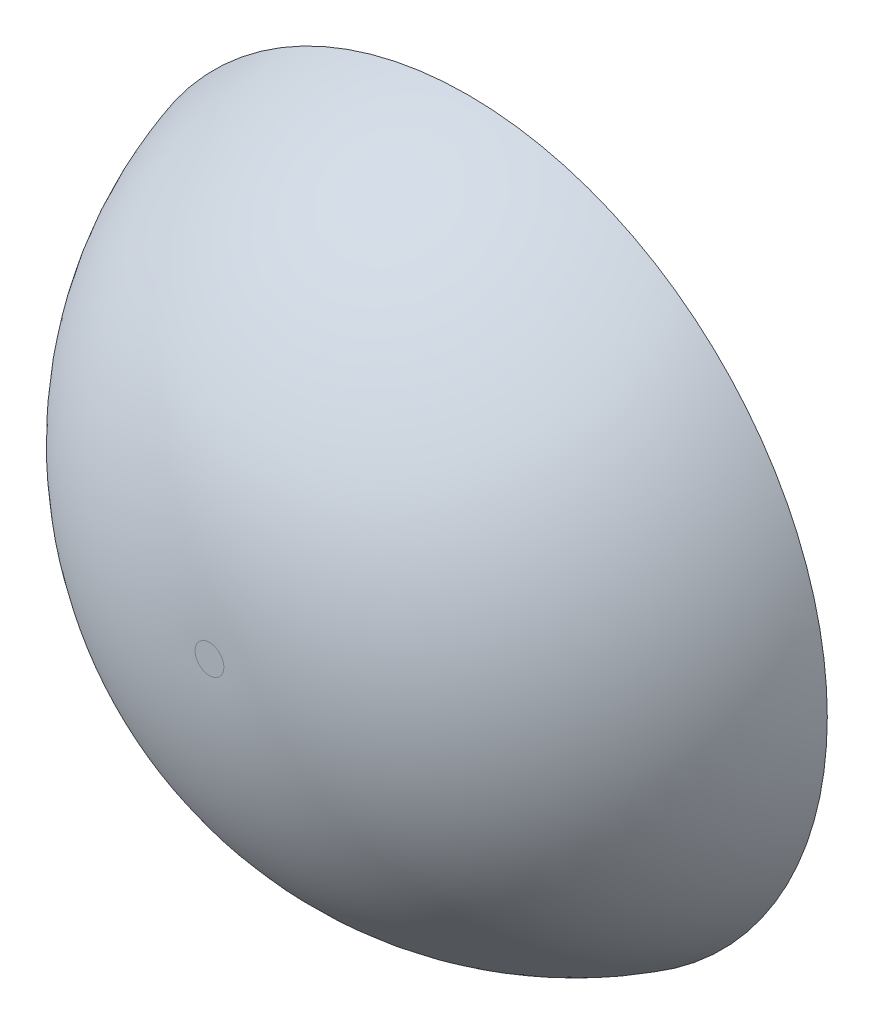
ISO-10303-21;
HEADER;
FILE_DESCRIPTION(('STEP AP214'),'2;1');
FILE_NAME('part.step','',(''),(''),'','','');
FILE_SCHEMA(('AUTOMOTIVE_DESIGN { 1 0 10303 214 1 1 1 1 }'));
ENDSEC;
DATA;
#1=APPLICATION_CONTEXT('core data for automotive mechanical design processes');
#2=APPLICATION_PROTOCOL_DEFINITION('international standard','automotive_design',2000,#1);
#3=PRODUCT_CONTEXT('',#1,'mechanical');
#4=PRODUCT('Part','Part','',(#3));
#5=PRODUCT_RELATED_PRODUCT_CATEGORY('part','',(#4));
#6=PRODUCT_DEFINITION_FORMATION('','',#4);
#7=PRODUCT_DEFINITION_CONTEXT('part definition',#1,'design');
#8=PRODUCT_DEFINITION('design','',#6,#7);
#9=PRODUCT_DEFINITION_SHAPE('','',#8);
#10=(LENGTH_UNIT() NAMED_UNIT(*) SI_UNIT(.MILLI.,.METRE.));
#11=(NAMED_UNIT(*) PLANE_ANGLE_UNIT() SI_UNIT($,.RADIAN.));
#12=(NAMED_UNIT(*) SI_UNIT($,.STERADIAN.) SOLID_ANGLE_UNIT());
#13=UNCERTAINTY_MEASURE_WITH_UNIT(LENGTH_MEASURE(1.E-05),#10,'distance_accuracy_value','');
#14=(GEOMETRIC_REPRESENTATION_CONTEXT(3) GLOBAL_UNCERTAINTY_ASSIGNED_CONTEXT((#13)) GLOBAL_UNIT_ASSIGNED_CONTEXT((#10,
#11,#12)) REPRESENTATION_CONTEXT('',''));
#15=CARTESIAN_POINT('',(0.,0.,0.));
#16=DIRECTION('',(0.,0.,1.));
#17=DIRECTION('',(1.,0.,0.));
#18=AXIS2_PLACEMENT_3D('',#15,#16,#17);
#19=CARTESIAN_POINT('',(0.,0.,18.));
#20=DIRECTION('',(0.,0.,1.));
#21=DIRECTION('',(1.,0.,0.));
#22=AXIS2_PLACEMENT_3D('',#19,#20,#21);
#23=PLANE('',#22);
#24=CARTESIAN_POINT('',(0.,0.,18.));
#25=DIRECTION('',(0.,0.,1.));
#26=DIRECTION('',(1.,0.,0.));
#27=AXIS2_PLACEMENT_3D('',#24,#25,#26);
#28=CIRCLE('',#27,0.999999999999997);
#29=CARTESIAN_POINT('',(0.999999999999997,0.,18.));
#30=VERTEX_POINT('',#29);
#31=EDGE_CURVE('E10',#30,#30,#28,.T.);
#32=ORIENTED_EDGE('',*,*,#31,.T.);
#33=EDGE_LOOP('',(#32));
#34=FACE_BOUND('',#33,.T.);
#35=ADVANCED_FACE('F33',(#34),#23,.T.);
#36=CARTESIAN_POINT('',(0.,0.,0.));
#37=DIRECTION('',(0.,0.,1.));
#38=DIRECTION('',(1.,0.,0.));
#39=AXIS2_PLACEMENT_3D('',#36,#37,#38);
#40=PLANE('',#39);
#41=CARTESIAN_POINT('',(-6.9703966151604,-12.0730810863642,0.));
#42=DIRECTION('',(0.,0.,1.));
#43=DIRECTION('',(0.499999999999992,0.866025403784443,0.));
#44=AXIS2_PLACEMENT_3D('',#41,#42,#43);
#45=ELLIPSE('',#44,3.15250024912521,2.15);
#46=CARTESIAN_POINT('',(-5.39414649059782,-9.34293578518498,0.));
#47=VERTEX_POINT('',#46);
#48=EDGE_CURVE('E37',#47,#47,#45,.T.);
#49=ORIENTED_EDGE('',*,*,#48,.T.);
#50=EDGE_LOOP('',(#49));
#51=FACE_BOUND('',#50,.T.);
#52=CARTESIAN_POINT('',(-6.97039661516057,12.0730810863641,0.));
#53=DIRECTION('',(0.,0.,1.));
#54=DIRECTION('',(0.500000000000004,-0.866025403784436,0.));
#55=AXIS2_PLACEMENT_3D('',#52,#53,#54);
#56=ELLIPSE('',#55,3.15250024912521,2.15);
#57=CARTESIAN_POINT('',(-5.39414649059795,9.3429357851849,0.));
#58=VERTEX_POINT('',#57);
#59=EDGE_CURVE('E52',#58,#58,#56,.T.);
#60=ORIENTED_EDGE('',*,*,#59,.T.);
#61=EDGE_LOOP('',(#60));
#62=FACE_BOUND('',#61,.T.);
#63=CARTESIAN_POINT('',(13.940793230321,0.,0.));
#64=DIRECTION('',(0.,0.,1.));
#65=DIRECTION('',(-1.,0.,0.));
#66=AXIS2_PLACEMENT_3D('',#63,#64,#65);
#67=ELLIPSE('',#66,3.15250024912521,2.15);
#68=CARTESIAN_POINT('',(10.7882929811958,0.,0.));
#69=VERTEX_POINT('',#68);
#70=EDGE_CURVE('E46',#69,#69,#67,.T.);
#71=ORIENTED_EDGE('',*,*,#70,.T.);
#72=EDGE_LOOP('',(#71));
#73=FACE_BOUND('',#72,.T.);
#74=CARTESIAN_POINT('',(0.,0.,0.));
#75=DIRECTION('',(0.,0.,1.));
#76=DIRECTION('',(1.,0.,0.));
#77=AXIS2_PLACEMENT_3D('',#74,#75,#76);
#78=CIRCLE('',#77,25.);
#79=CARTESIAN_POINT('',(25.,0.,0.));
#80=VERTEX_POINT('',#79);
#81=EDGE_CURVE('E41',#80,#80,#78,.T.);
#82=ORIENTED_EDGE('',*,*,#81,.F.);
#83=EDGE_LOOP('',(#82));
#84=FACE_BOUND('',#83,.T.);
#85=ADVANCED_FACE('F80',(#51,#62,#73,#84),#40,.F.);
#86=CARTESIAN_POINT('',(0.,0.,-7.));
#87=DIRECTION('',(0.,0.,-1.));
#88=DIRECTION('',(-1.,0.,0.));
#89=AXIS2_PLACEMENT_3D('',#86,#87,#88);
#90=DEGENERATE_TOROIDAL_SURFACE('',#89,0.999999999999997,25.,.T.);
#91=ORIENTED_EDGE('',*,*,#81,.T.);
#92=EDGE_LOOP('',(#91));
#93=FACE_BOUND('',#92,.T.);
#94=ORIENTED_EDGE('',*,*,#31,.F.);
#95=EDGE_LOOP('',(#94));
#96=FACE_BOUND('',#95,.T.);
#97=ADVANCED_FACE('F35',(#93,#96),#90,.T.);
#98=CARTESIAN_POINT('',(0.,0.,13.));
#99=DIRECTION('',(-0.731353701619174,0.,0.681998360062495));
#100=DIRECTION('',(0.681998360062495,0.,0.731353701619174));
#101=AXIS2_PLACEMENT_3D('',#98,#99,#100);
#102=CYLINDRICAL_SURFACE('',#101,2.15);
#103=CARTESIAN_POINT('',(3.65676850809587,0.,9.59000819968753));
#104=DIRECTION('',(-0.731353701619174,0.,0.681998360062495));
#105=DIRECTION('',(0.681998360062495,0.,0.731353701619174));
#106=AXIS2_PLACEMENT_3D('',#103,#104,#105);
#107=CIRCLE('',#106,2.15);
#108=CARTESIAN_POINT('',(5.12306498223024,0.,11.1624186581688));
#109=VERTEX_POINT('',#108);
#110=EDGE_CURVE('E51',#109,#109,#107,.T.);
#111=ORIENTED_EDGE('',*,*,#110,.T.);
#112=EDGE_LOOP('',(#111));
#113=FACE_BOUND('',#112,.T.);
#114=ORIENTED_EDGE('',*,*,#70,.F.);
#115=EDGE_LOOP('',(#114));
#116=FACE_BOUND('',#115,.T.);
#117=ADVANCED_FACE('F87',(#113,#116),#102,.F.);
#118=CARTESIAN_POINT('',(3.65676850809587,0.,9.59000819968752));
#119=DIRECTION('',(-0.731353701619174,0.,0.681998360062495));
#120=DIRECTION('',(0.681998360062495,0.,0.731353701619174));
#121=AXIS2_PLACEMENT_3D('',#118,#119,#120);
#122=PLANE('',#121);
#123=ORIENTED_EDGE('',*,*,#110,.F.);
#124=EDGE_LOOP('',(#123));
#125=FACE_BOUND('',#124,.T.);
#126=ADVANCED_FACE('F90',(#125),#122,.F.);
#127=CARTESIAN_POINT('',(0.,0.,13.));
#128=DIRECTION('',(0.36567685080959,-0.633370884753988,0.681998360062495));
#129=DIRECTION('',(-0.34099918003125,0.590627905153445,0.731353701619174));
#130=AXIS2_PLACEMENT_3D('',#127,#128,#129);
#131=CYLINDRICAL_SURFACE('',#130,2.15);
#132=CARTESIAN_POINT('',(-1.82838425404795,3.16685442376994,9.59000819968753));
#133=DIRECTION('',(0.36567685080959,-0.633370884753988,0.681998360062495));
#134=DIRECTION('',(-0.34099918003125,0.590627905153445,0.731353701619174));
#135=AXIS2_PLACEMENT_3D('',#132,#133,#134);
#136=CIRCLE('',#135,2.15);
#137=CARTESIAN_POINT('',(-2.56153249111514,4.43670441984985,11.1624186581688));
#138=VERTEX_POINT('',#137);
#139=EDGE_CURVE('E54',#138,#138,#136,.T.);
#140=ORIENTED_EDGE('',*,*,#139,.T.);
#141=EDGE_LOOP('',(#140));
#142=FACE_BOUND('',#141,.T.);
#143=ORIENTED_EDGE('',*,*,#59,.F.);
#144=EDGE_LOOP('',(#143));
#145=FACE_BOUND('',#144,.T.);
#146=ADVANCED_FACE('F94',(#142,#145),#131,.F.);
#147=CARTESIAN_POINT('',(-1.82838425404795,3.16685442376994,9.59000819968752));
#148=DIRECTION('',(0.36567685080959,-0.633370884753988,0.681998360062495));
#149=DIRECTION('',(-0.34099918003125,0.590627905153445,0.731353701619174));
#150=AXIS2_PLACEMENT_3D('',#147,#148,#149);
#151=PLANE('',#150);
#152=ORIENTED_EDGE('',*,*,#139,.F.);
#153=EDGE_LOOP('',(#152));
#154=FACE_BOUND('',#153,.T.);
#155=ADVANCED_FACE('F77',(#154),#151,.F.);
#156=CARTESIAN_POINT('',(0.,0.,13.));
#157=DIRECTION('',(0.365676850809581,0.633370884753993,0.681998360062495));
#158=DIRECTION('',(-0.340999180031242,-0.59062790515345,0.731353701619174));
#159=AXIS2_PLACEMENT_3D('',#156,#157,#158);
#160=CYLINDRICAL_SURFACE('',#159,2.15);
#161=CARTESIAN_POINT('',(-1.82838425404791,-3.16685442376996,9.59000819968753));
#162=DIRECTION('',(0.365676850809581,0.633370884753993,0.681998360062495));
#163=DIRECTION('',(-0.340999180031242,-0.59062790515345,0.731353701619174));
#164=AXIS2_PLACEMENT_3D('',#161,#162,#163);
#165=CIRCLE('',#164,2.15);
#166=CARTESIAN_POINT('',(-2.56153249111508,-4.43670441984988,11.1624186581688));
#167=VERTEX_POINT('',#166);
#168=EDGE_CURVE('E63',#167,#167,#165,.T.);
#169=ORIENTED_EDGE('',*,*,#168,.T.);
#170=EDGE_LOOP('',(#169));
#171=FACE_BOUND('',#170,.T.);
#172=ORIENTED_EDGE('',*,*,#48,.F.);
#173=EDGE_LOOP('',(#172));
#174=FACE_BOUND('',#173,.T.);
#175=ADVANCED_FACE('F68',(#171,#174),#160,.F.);
#176=CARTESIAN_POINT('',(-1.82838425404791,-3.16685442376996,9.59000819968752));
#177=DIRECTION('',(0.365676850809581,0.633370884753993,0.681998360062495));
#178=DIRECTION('',(-0.340999180031242,-0.59062790515345,0.731353701619174));
#179=AXIS2_PLACEMENT_3D('',#176,#177,#178);
#180=PLANE('',#179);
#181=ORIENTED_EDGE('',*,*,#168,.F.);
#182=EDGE_LOOP('',(#181));
#183=FACE_BOUND('',#182,.T.);
#184=ADVANCED_FACE('F71',(#183),#180,.F.);
#185=CLOSED_SHELL('',(#35,#85,#97,#117,#126,#146,#155,#175,#184));
#186=MANIFOLD_SOLID_BREP('B2',#185);
#187=ADVANCED_BREP_SHAPE_REPRESENTATION('',(#18,#186),#14);
#188=SHAPE_DEFINITION_REPRESENTATION(#9,#187);
ENDSEC;
END-ISO-10303-21;
